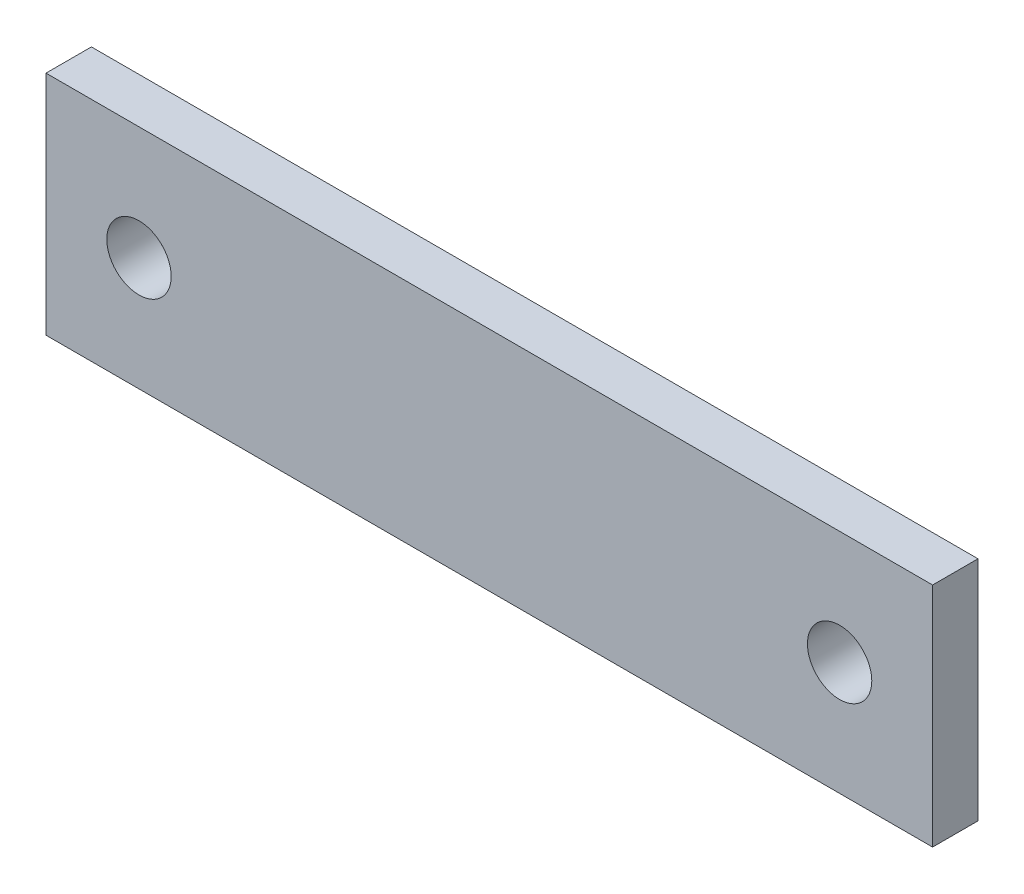
ISO-10303-21;
HEADER;
FILE_DESCRIPTION(('STEP AP214'),'2;1');
FILE_NAME('part.step','',(''),(''),'','','');
FILE_SCHEMA(('AUTOMOTIVE_DESIGN { 1 0 10303 214 1 1 1 1 }'));
ENDSEC;
DATA;
#1=APPLICATION_CONTEXT('core data for automotive mechanical design processes');
#2=APPLICATION_PROTOCOL_DEFINITION('international standard','automotive_design',2000,#1);
#3=PRODUCT_CONTEXT('',#1,'mechanical');
#4=PRODUCT('Part','Part','',(#3));
#5=PRODUCT_RELATED_PRODUCT_CATEGORY('part','',(#4));
#6=PRODUCT_DEFINITION_FORMATION('','',#4);
#7=PRODUCT_DEFINITION_CONTEXT('part definition',#1,'design');
#8=PRODUCT_DEFINITION('design','',#6,#7);
#9=PRODUCT_DEFINITION_SHAPE('','',#8);
#10=(LENGTH_UNIT() NAMED_UNIT(*) SI_UNIT(.MILLI.,.METRE.));
#11=(NAMED_UNIT(*) PLANE_ANGLE_UNIT() SI_UNIT($,.RADIAN.));
#12=(NAMED_UNIT(*) SI_UNIT($,.STERADIAN.) SOLID_ANGLE_UNIT());
#13=UNCERTAINTY_MEASURE_WITH_UNIT(LENGTH_MEASURE(1.E-05),#10,'distance_accuracy_value','');
#14=(GEOMETRIC_REPRESENTATION_CONTEXT(3) GLOBAL_UNCERTAINTY_ASSIGNED_CONTEXT((#13)) GLOBAL_UNIT_ASSIGNED_CONTEXT((#10,
#11,#12)) REPRESENTATION_CONTEXT('',''));
#15=CARTESIAN_POINT('',(0.,0.,0.));
#16=DIRECTION('',(0.,0.,1.));
#17=DIRECTION('',(1.,0.,0.));
#18=AXIS2_PLACEMENT_3D('',#15,#16,#17);
#19=CARTESIAN_POINT('',(-30.5784775413711,16.9367860520094,3.175));
#20=DIRECTION('',(1.,0.,0.));
#21=DIRECTION('',(0.,0.,-1.));
#22=AXIS2_PLACEMENT_3D('',#19,#20,#21);
#23=PLANE('',#22);
#24=DIRECTION('',(0.,-1.,0.));
#25=VECTOR('',#24,1.);
#26=CARTESIAN_POINT('',(-30.5784775413711,16.9367860520094,0.));
#27=LINE('',#26,#25);
#28=CARTESIAN_POINT('',(-30.5784775413711,16.9367860520094,0.));
#29=VERTEX_POINT('',#28);
#30=CARTESIAN_POINT('',(-30.5784775413711,1.06178605200945,0.));
#31=VERTEX_POINT('',#30);
#32=EDGE_CURVE('E96',#29,#31,#27,.T.);
#33=ORIENTED_EDGE('',*,*,#32,.T.);
#34=DIRECTION('',(0.,0.,-1.));
#35=VECTOR('',#34,1.);
#36=CARTESIAN_POINT('',(-30.5784775413711,1.06178605200945,3.175));
#37=LINE('',#36,#35);
#38=CARTESIAN_POINT('',(-30.5784775413711,1.06178605200945,3.175));
#39=VERTEX_POINT('',#38);
#40=EDGE_CURVE('E11',#39,#31,#37,.T.);
#41=ORIENTED_EDGE('',*,*,#40,.F.);
#42=DIRECTION('',(0.,-1.,0.));
#43=VECTOR('',#42,1.);
#44=CARTESIAN_POINT('',(-30.5784775413711,16.9367860520094,3.175));
#45=LINE('',#44,#43);
#46=CARTESIAN_POINT('',(-30.5784775413711,16.9367860520094,3.175));
#47=VERTEX_POINT('',#46);
#48=EDGE_CURVE('E84',#47,#39,#45,.T.);
#49=ORIENTED_EDGE('',*,*,#48,.F.);
#50=DIRECTION('',(0.,0.,-1.));
#51=VECTOR('',#50,1.);
#52=CARTESIAN_POINT('',(-30.5784775413711,16.9367860520094,3.175));
#53=LINE('',#52,#51);
#54=EDGE_CURVE('E92',#47,#29,#53,.T.);
#55=ORIENTED_EDGE('',*,*,#54,.T.);
#56=EDGE_LOOP('',(#33,#41,#49,#55));
#57=FACE_BOUND('',#56,.T.);
#58=ADVANCED_FACE('F33',(#57),#23,.F.);
#59=CARTESIAN_POINT('',(-30.5784775413711,1.06178605200945,3.175));
#60=DIRECTION('',(0.,1.,0.));
#61=DIRECTION('',(0.,0.,1.));
#62=AXIS2_PLACEMENT_3D('',#59,#60,#61);
#63=PLANE('',#62);
#64=DIRECTION('',(1.,0.,0.));
#65=VECTOR('',#64,1.);
#66=CARTESIAN_POINT('',(-30.5784775413711,1.06178605200945,0.));
#67=LINE('',#66,#65);
#68=CARTESIAN_POINT('',(31.4229224586289,1.06178605200945,0.));
#69=VERTEX_POINT('',#68);
#70=EDGE_CURVE('E88',#31,#69,#67,.T.);
#71=ORIENTED_EDGE('',*,*,#70,.T.);
#72=DIRECTION('',(0.,0.,-1.));
#73=VECTOR('',#72,1.);
#74=CARTESIAN_POINT('',(31.4229224586289,1.06178605200945,3.175));
#75=LINE('',#74,#73);
#76=CARTESIAN_POINT('',(31.4229224586289,1.06178605200945,3.175));
#77=VERTEX_POINT('',#76);
#78=EDGE_CURVE('E41',#77,#69,#75,.T.);
#79=ORIENTED_EDGE('',*,*,#78,.F.);
#80=DIRECTION('',(1.,0.,0.));
#81=VECTOR('',#80,1.);
#82=CARTESIAN_POINT('',(-30.5784775413711,1.06178605200945,3.175));
#83=LINE('',#82,#81);
#84=EDGE_CURVE('E79',#39,#77,#83,.T.);
#85=ORIENTED_EDGE('',*,*,#84,.F.);
#86=ORIENTED_EDGE('',*,*,#40,.T.);
#87=EDGE_LOOP('',(#71,#79,#85,#86));
#88=FACE_BOUND('',#87,.T.);
#89=ADVANCED_FACE('F87',(#88),#63,.F.);
#90=CARTESIAN_POINT('',(31.4229224586289,16.9367860520094,3.175));
#91=DIRECTION('',(-1.,0.,0.));
#92=DIRECTION('',(0.,0.,1.));
#93=AXIS2_PLACEMENT_3D('',#90,#91,#92);
#94=PLANE('',#93);
#95=DIRECTION('',(0.,1.,0.));
#96=VECTOR('',#95,1.);
#97=CARTESIAN_POINT('',(31.4229224586289,16.9367860520094,0.));
#98=LINE('',#97,#96);
#99=CARTESIAN_POINT('',(31.4229224586289,16.9367860520094,0.));
#100=VERTEX_POINT('',#99);
#101=EDGE_CURVE('E66',#69,#100,#98,.T.);
#102=ORIENTED_EDGE('',*,*,#101,.T.);
#103=DIRECTION('',(0.,0.,-1.));
#104=VECTOR('',#103,1.);
#105=CARTESIAN_POINT('',(31.4229224586289,16.9367860520094,3.175));
#106=LINE('',#105,#104);
#107=CARTESIAN_POINT('',(31.4229224586289,16.9367860520094,3.175));
#108=VERTEX_POINT('',#107);
#109=EDGE_CURVE('E89',#108,#100,#106,.T.);
#110=ORIENTED_EDGE('',*,*,#109,.F.);
#111=DIRECTION('',(0.,1.,0.));
#112=VECTOR('',#111,1.);
#113=CARTESIAN_POINT('',(31.4229224586289,16.9367860520094,3.175));
#114=LINE('',#113,#112);
#115=EDGE_CURVE('E82',#77,#108,#114,.T.);
#116=ORIENTED_EDGE('',*,*,#115,.F.);
#117=ORIENTED_EDGE('',*,*,#78,.T.);
#118=EDGE_LOOP('',(#102,#110,#116,#117));
#119=FACE_BOUND('',#118,.T.);
#120=ADVANCED_FACE('F90',(#119),#94,.F.);
#121=CARTESIAN_POINT('',(-30.5784775413711,16.9367860520094,3.175));
#122=DIRECTION('',(0.,-1.,0.));
#123=DIRECTION('',(0.,0.,-1.));
#124=AXIS2_PLACEMENT_3D('',#121,#122,#123);
#125=PLANE('',#124);
#126=DIRECTION('',(-1.,0.,0.));
#127=VECTOR('',#126,1.);
#128=CARTESIAN_POINT('',(-30.5784775413711,16.9367860520094,0.));
#129=LINE('',#128,#127);
#130=EDGE_CURVE('E72',#100,#29,#129,.T.);
#131=ORIENTED_EDGE('',*,*,#130,.T.);
#132=ORIENTED_EDGE('',*,*,#54,.F.);
#133=DIRECTION('',(-1.,0.,0.));
#134=VECTOR('',#133,1.);
#135=CARTESIAN_POINT('',(-30.5784775413711,16.9367860520094,3.175));
#136=LINE('',#135,#134);
#137=EDGE_CURVE('E49',#108,#47,#136,.T.);
#138=ORIENTED_EDGE('',*,*,#137,.F.);
#139=ORIENTED_EDGE('',*,*,#109,.T.);
#140=EDGE_LOOP('',(#131,#132,#138,#139));
#141=FACE_BOUND('',#140,.T.);
#142=ADVANCED_FACE('F104',(#141),#125,.F.);
#143=CARTESIAN_POINT('',(0.,0.,3.175));
#144=DIRECTION('',(0.,0.,1.));
#145=DIRECTION('',(1.,0.,0.));
#146=AXIS2_PLACEMENT_3D('',#143,#144,#145);
#147=PLANE('',#146);
#148=CARTESIAN_POINT('',(-24.0760775413711,8.99928605200945,3.175));
#149=DIRECTION('',(0.,0.,1.));
#150=DIRECTION('',(1.,0.,0.));
#151=AXIS2_PLACEMENT_3D('',#148,#149,#150);
#152=CIRCLE('',#151,2.25);
#153=CARTESIAN_POINT('',(-21.8260775413711,8.99928605200945,3.175));
#154=VERTEX_POINT('',#153);
#155=EDGE_CURVE('E118',#154,#154,#152,.T.);
#156=ORIENTED_EDGE('',*,*,#155,.F.);
#157=EDGE_LOOP('',(#156));
#158=FACE_BOUND('',#157,.T.);
#159=CARTESIAN_POINT('',(24.9205224586289,8.99928605200945,3.175));
#160=DIRECTION('',(0.,0.,1.));
#161=DIRECTION('',(1.,0.,0.));
#162=AXIS2_PLACEMENT_3D('',#159,#160,#161);
#163=CIRCLE('',#162,2.25);
#164=CARTESIAN_POINT('',(27.1705224586289,8.99928605200945,3.175));
#165=VERTEX_POINT('',#164);
#166=EDGE_CURVE('E112',#165,#165,#163,.T.);
#167=ORIENTED_EDGE('',*,*,#166,.F.);
#168=EDGE_LOOP('',(#167));
#169=FACE_BOUND('',#168,.T.);
#170=ORIENTED_EDGE('',*,*,#48,.T.);
#171=ORIENTED_EDGE('',*,*,#84,.T.);
#172=ORIENTED_EDGE('',*,*,#115,.T.);
#173=ORIENTED_EDGE('',*,*,#137,.T.);
#174=EDGE_LOOP('',(#170,#171,#172,#173));
#175=FACE_BOUND('',#174,.T.);
#176=ADVANCED_FACE('F80',(#158,#169,#175),#147,.T.);
#177=CARTESIAN_POINT('',(0.,0.,0.));
#178=DIRECTION('',(0.,0.,1.));
#179=DIRECTION('',(1.,0.,0.));
#180=AXIS2_PLACEMENT_3D('',#177,#178,#179);
#181=PLANE('',#180);
#182=CARTESIAN_POINT('',(-24.0760775413711,8.99928605200945,0.));
#183=DIRECTION('',(0.,0.,1.));
#184=DIRECTION('',(1.,0.,0.));
#185=AXIS2_PLACEMENT_3D('',#182,#183,#184);
#186=CIRCLE('',#185,2.25);
#187=CARTESIAN_POINT('',(-21.8260775413711,8.99928605200945,0.));
#188=VERTEX_POINT('',#187);
#189=EDGE_CURVE('E115',#188,#188,#186,.T.);
#190=ORIENTED_EDGE('',*,*,#189,.T.);
#191=EDGE_LOOP('',(#190));
#192=FACE_BOUND('',#191,.T.);
#193=CARTESIAN_POINT('',(24.9205224586289,8.99928605200945,0.));
#194=DIRECTION('',(0.,0.,1.));
#195=DIRECTION('',(1.,0.,0.));
#196=AXIS2_PLACEMENT_3D('',#193,#194,#195);
#197=CIRCLE('',#196,2.25);
#198=CARTESIAN_POINT('',(27.1705224586289,8.99928605200945,0.));
#199=VERTEX_POINT('',#198);
#200=EDGE_CURVE('E99',#199,#199,#197,.T.);
#201=ORIENTED_EDGE('',*,*,#200,.T.);
#202=EDGE_LOOP('',(#201));
#203=FACE_BOUND('',#202,.T.);
#204=ORIENTED_EDGE('',*,*,#32,.F.);
#205=ORIENTED_EDGE('',*,*,#130,.F.);
#206=ORIENTED_EDGE('',*,*,#101,.F.);
#207=ORIENTED_EDGE('',*,*,#70,.F.);
#208=EDGE_LOOP('',(#204,#205,#206,#207));
#209=FACE_BOUND('',#208,.T.);
#210=ADVANCED_FACE('F107',(#192,#203,#209),#181,.F.);
#211=CARTESIAN_POINT('',(24.9205224586289,8.99928605200945,3.175));
#212=DIRECTION('',(0.,0.,1.));
#213=DIRECTION('',(1.,0.,0.));
#214=AXIS2_PLACEMENT_3D('',#211,#212,#213);
#215=CYLINDRICAL_SURFACE('',#214,2.25);
#216=ORIENTED_EDGE('',*,*,#200,.F.);
#217=EDGE_LOOP('',(#216));
#218=FACE_BOUND('',#217,.T.);
#219=ORIENTED_EDGE('',*,*,#166,.T.);
#220=EDGE_LOOP('',(#219));
#221=FACE_BOUND('',#220,.T.);
#222=ADVANCED_FACE('F129',(#218,#221),#215,.F.);
#223=CARTESIAN_POINT('',(-24.0760775413711,8.99928605200945,3.175));
#224=DIRECTION('',(0.,0.,1.));
#225=DIRECTION('',(1.,0.,0.));
#226=AXIS2_PLACEMENT_3D('',#223,#224,#225);
#227=CYLINDRICAL_SURFACE('',#226,2.25);
#228=ORIENTED_EDGE('',*,*,#189,.F.);
#229=EDGE_LOOP('',(#228));
#230=FACE_BOUND('',#229,.T.);
#231=ORIENTED_EDGE('',*,*,#155,.T.);
#232=EDGE_LOOP('',(#231));
#233=FACE_BOUND('',#232,.T.);
#234=ADVANCED_FACE('F122',(#230,#233),#227,.F.);
#235=CLOSED_SHELL('',(#58,#89,#120,#142,#176,#210,#222,#234));
#236=MANIFOLD_SOLID_BREP('B2',#235);
#237=ADVANCED_BREP_SHAPE_REPRESENTATION('',(#18,#236),#14);
#238=SHAPE_DEFINITION_REPRESENTATION(#9,#237);
ENDSEC;
END-ISO-10303-21;
